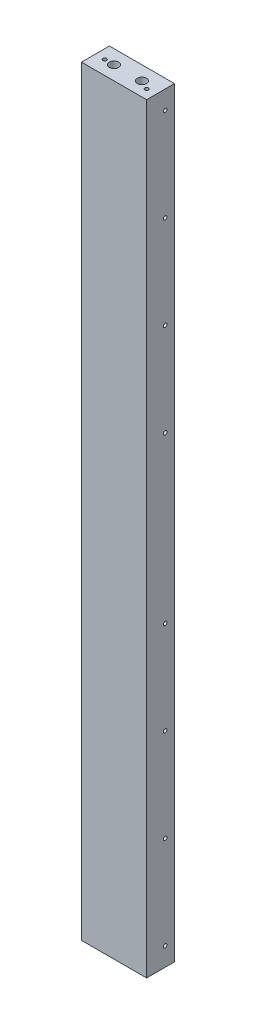
ISO-10303-21;
HEADER;
FILE_DESCRIPTION(('STEP AP214'),'2;1');
FILE_NAME('part.step','',(''),(''),'','','');
FILE_SCHEMA(('AUTOMOTIVE_DESIGN { 1 0 10303 214 1 1 1 1 }'));
ENDSEC;
DATA;
#1=APPLICATION_CONTEXT('core data for automotive mechanical design processes');
#2=APPLICATION_PROTOCOL_DEFINITION('international standard','automotive_design',2000,#1);
#3=PRODUCT_CONTEXT('',#1,'mechanical');
#4=PRODUCT('Part','Part','',(#3));
#5=PRODUCT_RELATED_PRODUCT_CATEGORY('part','',(#4));
#6=PRODUCT_DEFINITION_FORMATION('','',#4);
#7=PRODUCT_DEFINITION_CONTEXT('part definition',#1,'design');
#8=PRODUCT_DEFINITION('design','',#6,#7);
#9=PRODUCT_DEFINITION_SHAPE('','',#8);
#10=(LENGTH_UNIT() NAMED_UNIT(*) SI_UNIT(.MILLI.,.METRE.));
#11=(NAMED_UNIT(*) PLANE_ANGLE_UNIT() SI_UNIT($,.RADIAN.));
#12=(NAMED_UNIT(*) SI_UNIT($,.STERADIAN.) SOLID_ANGLE_UNIT());
#13=UNCERTAINTY_MEASURE_WITH_UNIT(LENGTH_MEASURE(1.E-05),#10,'distance_accuracy_value','');
#14=(GEOMETRIC_REPRESENTATION_CONTEXT(3) GLOBAL_UNCERTAINTY_ASSIGNED_CONTEXT((#13)) GLOBAL_UNIT_ASSIGNED_CONTEXT((#10,
#11,#12)) REPRESENTATION_CONTEXT('',''));
#15=CARTESIAN_POINT('',(0.,0.,0.));
#16=DIRECTION('',(0.,0.,1.));
#17=DIRECTION('',(1.,0.,0.));
#18=AXIS2_PLACEMENT_3D('',#15,#16,#17);
#19=CARTESIAN_POINT('',(0.,1038.225,0.));
#20=DIRECTION('',(1.,0.,0.));
#21=DIRECTION('',(0.,0.,-1.));
#22=AXIS2_PLACEMENT_3D('',#19,#20,#21);
#23=PLANE('',#22);
#24=DIRECTION('',(0.,0.,1.));
#25=VECTOR('',#24,1.);
#26=CARTESIAN_POINT('',(0.,0.,0.));
#27=LINE('',#26,#25);
#28=CARTESIAN_POINT('',(0.,0.,0.));
#29=VERTEX_POINT('',#28);
#30=CARTESIAN_POINT('',(0.,0.,38.1));
#31=VERTEX_POINT('',#30);
#32=EDGE_CURVE('E214',#29,#31,#27,.T.);
#33=ORIENTED_EDGE('',*,*,#32,.T.);
#34=DIRECTION('',(0.,-1.,0.));
#35=VECTOR('',#34,1.);
#36=CARTESIAN_POINT('',(0.,1038.225,38.1));
#37=LINE('',#36,#35);
#38=CARTESIAN_POINT('',(0.,1038.225,38.1));
#39=VERTEX_POINT('',#38);
#40=EDGE_CURVE('E12',#39,#31,#37,.T.);
#41=ORIENTED_EDGE('',*,*,#40,.F.);
#42=DIRECTION('',(0.,0.,1.));
#43=VECTOR('',#42,1.);
#44=CARTESIAN_POINT('',(0.,1038.225,0.));
#45=LINE('',#44,#43);
#46=CARTESIAN_POINT('',(0.,1038.225,0.));
#47=VERTEX_POINT('',#46);
#48=EDGE_CURVE('E221',#47,#39,#45,.T.);
#49=ORIENTED_EDGE('',*,*,#48,.F.);
#50=DIRECTION('',(0.,-1.,0.));
#51=VECTOR('',#50,1.);
#52=CARTESIAN_POINT('',(0.,1038.225,0.));
#53=LINE('',#52,#51);
#54=EDGE_CURVE('E211',#47,#29,#53,.T.);
#55=ORIENTED_EDGE('',*,*,#54,.T.);
#56=EDGE_LOOP('',(#33,#41,#49,#55));
#57=FACE_BOUND('',#56,.T.);
#58=ADVANCED_FACE('F56',(#57),#23,.F.);
#59=CARTESIAN_POINT('',(0.,1038.225,38.1));
#60=DIRECTION('',(0.,0.,-1.));
#61=DIRECTION('',(-1.,0.,0.));
#62=AXIS2_PLACEMENT_3D('',#59,#60,#61);
#63=PLANE('',#62);
#64=DIRECTION('',(1.,0.,0.));
#65=VECTOR('',#64,1.);
#66=CARTESIAN_POINT('',(0.,0.,38.1));
#67=LINE('',#66,#65);
#68=CARTESIAN_POINT('',(88.9,0.,38.1));
#69=VERTEX_POINT('',#68);
#70=EDGE_CURVE('E217',#31,#69,#67,.T.);
#71=ORIENTED_EDGE('',*,*,#70,.T.);
#72=DIRECTION('',(0.,-1.,0.));
#73=VECTOR('',#72,1.);
#74=CARTESIAN_POINT('',(88.9,1038.225,38.1));
#75=LINE('',#74,#73);
#76=CARTESIAN_POINT('',(88.9,1038.225,38.1));
#77=VERTEX_POINT('',#76);
#78=EDGE_CURVE('E64',#77,#69,#75,.T.);
#79=ORIENTED_EDGE('',*,*,#78,.F.);
#80=DIRECTION('',(1.,0.,0.));
#81=VECTOR('',#80,1.);
#82=CARTESIAN_POINT('',(0.,1038.225,38.1));
#83=LINE('',#82,#81);
#84=EDGE_CURVE('E103',#39,#77,#83,.T.);
#85=ORIENTED_EDGE('',*,*,#84,.F.);
#86=ORIENTED_EDGE('',*,*,#40,.T.);
#87=EDGE_LOOP('',(#71,#79,#85,#86));
#88=FACE_BOUND('',#87,.T.);
#89=ADVANCED_FACE('F245',(#88),#63,.F.);
#90=CARTESIAN_POINT('',(88.9,1038.225,0.));
#91=DIRECTION('',(-1.,0.,0.));
#92=DIRECTION('',(0.,0.,1.));
#93=AXIS2_PLACEMENT_3D('',#90,#91,#92);
#94=PLANE('',#93);
#95=CARTESIAN_POINT('',(88.9,25.4,12.7));
#96=DIRECTION('',(1.,0.,0.));
#97=DIRECTION('',(0.,0.,-1.));
#98=AXIS2_PLACEMENT_3D('',#95,#96,#97);
#99=CIRCLE('',#98,2.45744999999999);
#100=CARTESIAN_POINT('',(88.9,25.4,10.24255));
#101=VERTEX_POINT('',#100);
#102=EDGE_CURVE('E148',#101,#101,#99,.T.);
#103=ORIENTED_EDGE('',*,*,#102,.F.);
#104=EDGE_LOOP('',(#103));
#105=FACE_BOUND('',#104,.T.);
#106=CARTESIAN_POINT('',(88.9,152.4,12.7));
#107=DIRECTION('',(1.,0.,0.));
#108=DIRECTION('',(0.,0.,-1.));
#109=AXIS2_PLACEMENT_3D('',#106,#107,#108);
#110=CIRCLE('',#109,2.45745);
#111=CARTESIAN_POINT('',(88.9,152.4,10.24255));
#112=VERTEX_POINT('',#111);
#113=EDGE_CURVE('E147',#112,#112,#110,.T.);
#114=ORIENTED_EDGE('',*,*,#113,.F.);
#115=EDGE_LOOP('',(#114));
#116=FACE_BOUND('',#115,.T.);
#117=CARTESIAN_POINT('',(88.9,279.4,12.7));
#118=DIRECTION('',(1.,0.,0.));
#119=DIRECTION('',(0.,0.,-1.));
#120=AXIS2_PLACEMENT_3D('',#117,#118,#119);
#121=CIRCLE('',#120,2.45744999999997);
#122=CARTESIAN_POINT('',(88.9,279.4,10.24255));
#123=VERTEX_POINT('',#122);
#124=EDGE_CURVE('E158',#123,#123,#121,.T.);
#125=ORIENTED_EDGE('',*,*,#124,.F.);
#126=EDGE_LOOP('',(#125));
#127=FACE_BOUND('',#126,.T.);
#128=CARTESIAN_POINT('',(88.9,406.4,12.7));
#129=DIRECTION('',(1.,0.,0.));
#130=DIRECTION('',(0.,0.,-1.));
#131=AXIS2_PLACEMENT_3D('',#128,#129,#130);
#132=CIRCLE('',#131,2.45744999999997);
#133=CARTESIAN_POINT('',(88.9,406.4,10.24255));
#134=VERTEX_POINT('',#133);
#135=EDGE_CURVE('E164',#134,#134,#132,.T.);
#136=ORIENTED_EDGE('',*,*,#135,.F.);
#137=EDGE_LOOP('',(#136));
#138=FACE_BOUND('',#137,.T.);
#139=CARTESIAN_POINT('',(88.9,631.825,12.7));
#140=DIRECTION('',(1.,0.,0.));
#141=DIRECTION('',(0.,0.,-1.));
#142=AXIS2_PLACEMENT_3D('',#139,#140,#141);
#143=CIRCLE('',#142,2.45744999999997);
#144=CARTESIAN_POINT('',(88.9,631.825,10.24255));
#145=VERTEX_POINT('',#144);
#146=EDGE_CURVE('E170',#145,#145,#143,.T.);
#147=ORIENTED_EDGE('',*,*,#146,.F.);
#148=EDGE_LOOP('',(#147));
#149=FACE_BOUND('',#148,.T.);
#150=CARTESIAN_POINT('',(88.9,758.825,12.7));
#151=DIRECTION('',(1.,0.,0.));
#152=DIRECTION('',(0.,0.,-1.));
#153=AXIS2_PLACEMENT_3D('',#150,#151,#152);
#154=CIRCLE('',#153,2.45744999999997);
#155=CARTESIAN_POINT('',(88.9,758.825,10.24255));
#156=VERTEX_POINT('',#155);
#157=EDGE_CURVE('E176',#156,#156,#154,.T.);
#158=ORIENTED_EDGE('',*,*,#157,.F.);
#159=EDGE_LOOP('',(#158));
#160=FACE_BOUND('',#159,.T.);
#161=CARTESIAN_POINT('',(88.9,885.825,12.7));
#162=DIRECTION('',(1.,0.,0.));
#163=DIRECTION('',(0.,0.,-1.));
#164=AXIS2_PLACEMENT_3D('',#161,#162,#163);
#165=CIRCLE('',#164,2.45744999999997);
#166=CARTESIAN_POINT('',(88.9,885.825,10.24255));
#167=VERTEX_POINT('',#166);
#168=EDGE_CURVE('E182',#167,#167,#165,.T.);
#169=ORIENTED_EDGE('',*,*,#168,.F.);
#170=EDGE_LOOP('',(#169));
#171=FACE_BOUND('',#170,.T.);
#172=CARTESIAN_POINT('',(88.9,1012.825,12.7));
#173=DIRECTION('',(1.,0.,0.));
#174=DIRECTION('',(0.,0.,-1.));
#175=AXIS2_PLACEMENT_3D('',#172,#173,#174);
#176=CIRCLE('',#175,2.45745000000008);
#177=CARTESIAN_POINT('',(88.9,1012.825,10.2425499999999));
#178=VERTEX_POINT('',#177);
#179=EDGE_CURVE('E188',#178,#178,#176,.T.);
#180=ORIENTED_EDGE('',*,*,#179,.F.);
#181=EDGE_LOOP('',(#180));
#182=FACE_BOUND('',#181,.T.);
#183=DIRECTION('',(0.,0.,-1.));
#184=VECTOR('',#183,1.);
#185=CARTESIAN_POINT('',(88.9,0.,0.));
#186=LINE('',#185,#184);
#187=CARTESIAN_POINT('',(88.9,0.,0.));
#188=VERTEX_POINT('',#187);
#189=EDGE_CURVE('E90',#69,#188,#186,.T.);
#190=ORIENTED_EDGE('',*,*,#189,.T.);
#191=DIRECTION('',(0.,-1.,0.));
#192=VECTOR('',#191,1.);
#193=CARTESIAN_POINT('',(88.9,1038.225,0.));
#194=LINE('',#193,#192);
#195=CARTESIAN_POINT('',(88.9,1038.225,0.));
#196=VERTEX_POINT('',#195);
#197=EDGE_CURVE('E224',#196,#188,#194,.T.);
#198=ORIENTED_EDGE('',*,*,#197,.F.);
#199=DIRECTION('',(0.,0.,-1.));
#200=VECTOR('',#199,1.);
#201=CARTESIAN_POINT('',(88.9,1038.225,0.));
#202=LINE('',#201,#200);
#203=EDGE_CURVE('E212',#77,#196,#202,.T.);
#204=ORIENTED_EDGE('',*,*,#203,.F.);
#205=ORIENTED_EDGE('',*,*,#78,.T.);
#206=EDGE_LOOP('',(#190,#198,#204,#205));
#207=FACE_BOUND('',#206,.T.);
#208=ADVANCED_FACE('F226',(#105,#116,#127,#138,#149,#160,#171,#182,#207),#94,.F.);
#209=CARTESIAN_POINT('',(0.,1038.225,0.));
#210=DIRECTION('',(0.,0.,1.));
#211=DIRECTION('',(1.,0.,0.));
#212=AXIS2_PLACEMENT_3D('',#209,#210,#211);
#213=PLANE('',#212);
#214=DIRECTION('',(-1.,0.,0.));
#215=VECTOR('',#214,1.);
#216=CARTESIAN_POINT('',(0.,0.,0.));
#217=LINE('',#216,#215);
#218=EDGE_CURVE('E96',#188,#29,#217,.T.);
#219=ORIENTED_EDGE('',*,*,#218,.T.);
#220=ORIENTED_EDGE('',*,*,#54,.F.);
#221=DIRECTION('',(-1.,0.,0.));
#222=VECTOR('',#221,1.);
#223=CARTESIAN_POINT('',(0.,1038.225,0.));
#224=LINE('',#223,#222);
#225=EDGE_CURVE('E72',#196,#47,#224,.T.);
#226=ORIENTED_EDGE('',*,*,#225,.F.);
#227=ORIENTED_EDGE('',*,*,#197,.T.);
#228=EDGE_LOOP('',(#219,#220,#226,#227));
#229=FACE_BOUND('',#228,.T.);
#230=ADVANCED_FACE('F233',(#229),#213,.F.);
#231=CARTESIAN_POINT('',(0.,1038.225,0.));
#232=DIRECTION('',(0.,1.,0.));
#233=DIRECTION('',(0.,0.,1.));
#234=AXIS2_PLACEMENT_3D('',#231,#232,#233);
#235=PLANE('',#234);
#236=CARTESIAN_POINT('',(12.7,1038.225,19.05));
#237=DIRECTION('',(0.,1.,0.));
#238=DIRECTION('',(0.,0.,1.));
#239=AXIS2_PLACEMENT_3D('',#236,#237,#238);
#240=CIRCLE('',#239,2.45744999999999);
#241=CARTESIAN_POINT('',(12.7,1038.225,21.50745));
#242=VERTEX_POINT('',#241);
#243=EDGE_CURVE('E200',#242,#242,#240,.T.);
#244=ORIENTED_EDGE('',*,*,#243,.F.);
#245=EDGE_LOOP('',(#244));
#246=FACE_BOUND('',#245,.T.);
#247=CARTESIAN_POINT('',(76.2,1038.225,25.4));
#248=DIRECTION('',(0.,1.,0.));
#249=DIRECTION('',(0.,0.,1.));
#250=AXIS2_PLACEMENT_3D('',#247,#248,#249);
#251=CIRCLE('',#250,2.45744999999999);
#252=CARTESIAN_POINT('',(76.2,1038.225,27.85745));
#253=VERTEX_POINT('',#252);
#254=EDGE_CURVE('E651',#253,#253,#251,.T.);
#255=ORIENTED_EDGE('',*,*,#254,.F.);
#256=EDGE_LOOP('',(#255));
#257=FACE_BOUND('',#256,.T.);
#258=CARTESIAN_POINT('',(25.4,1038.225,19.05));
#259=DIRECTION('',(0.,1.,0.));
#260=DIRECTION('',(0.,0.,1.));
#261=AXIS2_PLACEMENT_3D('',#258,#259,#260);
#262=CIRCLE('',#261,6.35000000000001);
#263=CARTESIAN_POINT('',(25.4,1038.225,25.4));
#264=VERTEX_POINT('',#263);
#265=EDGE_CURVE('E637',#264,#264,#262,.T.);
#266=ORIENTED_EDGE('',*,*,#265,.F.);
#267=EDGE_LOOP('',(#266));
#268=FACE_BOUND('',#267,.T.);
#269=CARTESIAN_POINT('',(63.5,1038.225,19.05));
#270=DIRECTION('',(0.,1.,0.));
#271=DIRECTION('',(0.,0.,1.));
#272=AXIS2_PLACEMENT_3D('',#269,#270,#271);
#273=CIRCLE('',#272,6.35000000000001);
#274=CARTESIAN_POINT('',(63.5,1038.225,25.4));
#275=VERTEX_POINT('',#274);
#276=EDGE_CURVE('E640',#275,#275,#273,.T.);
#277=ORIENTED_EDGE('',*,*,#276,.F.);
#278=EDGE_LOOP('',(#277));
#279=FACE_BOUND('',#278,.T.);
#280=ORIENTED_EDGE('',*,*,#48,.T.);
#281=ORIENTED_EDGE('',*,*,#84,.T.);
#282=ORIENTED_EDGE('',*,*,#203,.T.);
#283=ORIENTED_EDGE('',*,*,#225,.T.);
#284=EDGE_LOOP('',(#280,#281,#282,#283));
#285=FACE_BOUND('',#284,.T.);
#286=ADVANCED_FACE('F235',(#246,#257,#268,#279,#285),#235,.T.);
#287=CARTESIAN_POINT('',(0.,0.,0.));
#288=DIRECTION('',(0.,1.,0.));
#289=DIRECTION('',(0.,0.,1.));
#290=AXIS2_PLACEMENT_3D('',#287,#288,#289);
#291=PLANE('',#290);
#292=CARTESIAN_POINT('',(44.45,0.,25.4));
#293=DIRECTION('',(0.,-1.,0.));
#294=DIRECTION('',(0.,0.,-1.));
#295=AXIS2_PLACEMENT_3D('',#292,#293,#294);
#296=CIRCLE('',#295,2.45744999999999);
#297=CARTESIAN_POINT('',(44.45,0.,22.94255));
#298=VERTEX_POINT('',#297);
#299=EDGE_CURVE('E194',#298,#298,#296,.T.);
#300=ORIENTED_EDGE('',*,*,#299,.F.);
#301=EDGE_LOOP('',(#300));
#302=FACE_BOUND('',#301,.T.);
#303=CARTESIAN_POINT('',(25.4,0.,19.05));
#304=DIRECTION('',(0.,-1.,0.));
#305=DIRECTION('',(0.,0.,-1.));
#306=AXIS2_PLACEMENT_3D('',#303,#304,#305);
#307=CIRCLE('',#306,6.35000000000001);
#308=CARTESIAN_POINT('',(25.4,0.,12.7));
#309=VERTEX_POINT('',#308);
#310=EDGE_CURVE('E621',#309,#309,#307,.T.);
#311=ORIENTED_EDGE('',*,*,#310,.F.);
#312=EDGE_LOOP('',(#311));
#313=FACE_BOUND('',#312,.T.);
#314=CARTESIAN_POINT('',(63.5,0.,19.05));
#315=DIRECTION('',(0.,-1.,0.));
#316=DIRECTION('',(0.,0.,-1.));
#317=AXIS2_PLACEMENT_3D('',#314,#315,#316);
#318=CIRCLE('',#317,6.35);
#319=CARTESIAN_POINT('',(63.5,0.,12.7));
#320=VERTEX_POINT('',#319);
#321=EDGE_CURVE('E624',#320,#320,#318,.T.);
#322=ORIENTED_EDGE('',*,*,#321,.F.);
#323=EDGE_LOOP('',(#322));
#324=FACE_BOUND('',#323,.T.);
#325=ORIENTED_EDGE('',*,*,#32,.F.);
#326=ORIENTED_EDGE('',*,*,#218,.F.);
#327=ORIENTED_EDGE('',*,*,#189,.F.);
#328=ORIENTED_EDGE('',*,*,#70,.F.);
#329=EDGE_LOOP('',(#325,#326,#327,#328));
#330=FACE_BOUND('',#329,.T.);
#331=ADVANCED_FACE('F229',(#302,#313,#324,#330),#291,.F.);
#332=CARTESIAN_POINT('',(63.5,1019.175,19.05));
#333=DIRECTION('',(0.,1.,0.));
#334=DIRECTION('',(0.,0.,1.));
#335=AXIS2_PLACEMENT_3D('',#332,#333,#334);
#336=CYLINDRICAL_SURFACE('',#335,6.35000000000001);
#337=CARTESIAN_POINT('',(63.5,1019.175,19.05));
#338=DIRECTION('',(0.,1.,0.));
#339=DIRECTION('',(0.,0.,1.));
#340=AXIS2_PLACEMENT_3D('',#337,#338,#339);
#341=CIRCLE('',#340,6.35000000000001);
#342=CARTESIAN_POINT('',(63.5,1019.175,25.4));
#343=VERTEX_POINT('',#342);
#344=EDGE_CURVE('E643',#343,#343,#341,.T.);
#345=ORIENTED_EDGE('',*,*,#344,.F.);
#346=EDGE_LOOP('',(#345));
#347=FACE_BOUND('',#346,.T.);
#348=ORIENTED_EDGE('',*,*,#276,.T.);
#349=EDGE_LOOP('',(#348));
#350=FACE_BOUND('',#349,.T.);
#351=ADVANCED_FACE('F286',(#347,#350),#336,.F.);
#352=CARTESIAN_POINT('',(63.5,1019.175,19.05));
#353=DIRECTION('',(0.,1.,0.));
#354=DIRECTION('',(0.,0.,1.));
#355=AXIS2_PLACEMENT_3D('',#352,#353,#354);
#356=PLANE('',#355);
#357=ORIENTED_EDGE('',*,*,#344,.T.);
#358=EDGE_LOOP('',(#357));
#359=FACE_BOUND('',#358,.T.);
#360=ADVANCED_FACE('F295',(#359),#356,.T.);
#361=CARTESIAN_POINT('',(25.4,1019.175,19.05));
#362=DIRECTION('',(0.,1.,0.));
#363=DIRECTION('',(0.,0.,1.));
#364=AXIS2_PLACEMENT_3D('',#361,#362,#363);
#365=CYLINDRICAL_SURFACE('',#364,6.35000000000001);
#366=CARTESIAN_POINT('',(25.4,1019.175,19.05));
#367=DIRECTION('',(0.,1.,0.));
#368=DIRECTION('',(0.,0.,1.));
#369=AXIS2_PLACEMENT_3D('',#366,#367,#368);
#370=CIRCLE('',#369,6.35000000000001);
#371=CARTESIAN_POINT('',(25.4,1019.175,25.4));
#372=VERTEX_POINT('',#371);
#373=EDGE_CURVE('E218',#372,#372,#370,.T.);
#374=ORIENTED_EDGE('',*,*,#373,.F.);
#375=EDGE_LOOP('',(#374));
#376=FACE_BOUND('',#375,.T.);
#377=ORIENTED_EDGE('',*,*,#265,.T.);
#378=EDGE_LOOP('',(#377));
#379=FACE_BOUND('',#378,.T.);
#380=ADVANCED_FACE('F305',(#376,#379),#365,.F.);
#381=CARTESIAN_POINT('',(25.4,1019.175,19.05));
#382=DIRECTION('',(0.,1.,0.));
#383=DIRECTION('',(0.,0.,1.));
#384=AXIS2_PLACEMENT_3D('',#381,#382,#383);
#385=PLANE('',#384);
#386=ORIENTED_EDGE('',*,*,#373,.T.);
#387=EDGE_LOOP('',(#386));
#388=FACE_BOUND('',#387,.T.);
#389=ADVANCED_FACE('F315',(#388),#385,.T.);
#390=CARTESIAN_POINT('',(63.5,19.05,19.05));
#391=DIRECTION('',(0.,-1.,0.));
#392=DIRECTION('',(0.,0.,-1.));
#393=AXIS2_PLACEMENT_3D('',#390,#391,#392);
#394=CYLINDRICAL_SURFACE('',#393,6.35);
#395=CARTESIAN_POINT('',(63.5,19.05,19.05));
#396=DIRECTION('',(0.,-1.,0.));
#397=DIRECTION('',(0.,0.,-1.));
#398=AXIS2_PLACEMENT_3D('',#395,#396,#397);
#399=CIRCLE('',#398,6.35);
#400=CARTESIAN_POINT('',(63.5,19.05,12.7));
#401=VERTEX_POINT('',#400);
#402=EDGE_CURVE('E626',#401,#401,#399,.T.);
#403=ORIENTED_EDGE('',*,*,#402,.F.);
#404=EDGE_LOOP('',(#403));
#405=FACE_BOUND('',#404,.T.);
#406=ORIENTED_EDGE('',*,*,#321,.T.);
#407=EDGE_LOOP('',(#406));
#408=FACE_BOUND('',#407,.T.);
#409=ADVANCED_FACE('F325',(#405,#408),#394,.F.);
#410=CARTESIAN_POINT('',(63.5,19.05,19.05));
#411=DIRECTION('',(0.,-1.,0.));
#412=DIRECTION('',(0.,0.,-1.));
#413=AXIS2_PLACEMENT_3D('',#410,#411,#412);
#414=PLANE('',#413);
#415=ORIENTED_EDGE('',*,*,#402,.T.);
#416=EDGE_LOOP('',(#415));
#417=FACE_BOUND('',#416,.T.);
#418=ADVANCED_FACE('F335',(#417),#414,.T.);
#419=CARTESIAN_POINT('',(25.4,19.05,19.05));
#420=DIRECTION('',(0.,-1.,0.));
#421=DIRECTION('',(0.,0.,-1.));
#422=AXIS2_PLACEMENT_3D('',#419,#420,#421);
#423=CYLINDRICAL_SURFACE('',#422,6.35000000000001);
#424=CARTESIAN_POINT('',(25.4,19.05,19.05));
#425=DIRECTION('',(0.,-1.,0.));
#426=DIRECTION('',(0.,0.,-1.));
#427=AXIS2_PLACEMENT_3D('',#424,#425,#426);
#428=CIRCLE('',#427,6.35000000000001);
#429=CARTESIAN_POINT('',(25.4,19.05,12.7));
#430=VERTEX_POINT('',#429);
#431=EDGE_CURVE('E628',#430,#430,#428,.T.);
#432=ORIENTED_EDGE('',*,*,#431,.F.);
#433=EDGE_LOOP('',(#432));
#434=FACE_BOUND('',#433,.T.);
#435=ORIENTED_EDGE('',*,*,#310,.T.);
#436=EDGE_LOOP('',(#435));
#437=FACE_BOUND('',#436,.T.);
#438=ADVANCED_FACE('F345',(#434,#437),#423,.F.);
#439=CARTESIAN_POINT('',(25.4,19.05,19.05));
#440=DIRECTION('',(0.,-1.,0.));
#441=DIRECTION('',(0.,0.,-1.));
#442=AXIS2_PLACEMENT_3D('',#439,#440,#441);
#443=PLANE('',#442);
#444=ORIENTED_EDGE('',*,*,#431,.T.);
#445=EDGE_LOOP('',(#444));
#446=FACE_BOUND('',#445,.T.);
#447=ADVANCED_FACE('F355',(#446),#443,.T.);
#448=CARTESIAN_POINT('',(76.2,962.025,25.4));
#449=DIRECTION('',(0.,1.,0.));
#450=DIRECTION('',(0.,0.,1.));
#451=AXIS2_PLACEMENT_3D('',#448,#449,#450);
#452=CONICAL_SURFACE('',#451,2.45744999999997,1.02974425867666);
#453=CARTESIAN_POINT('',(76.2,960.548415071771,25.4));
#454=VERTEX_POINT('',#453);
#455=VERTEX_LOOP('',#454);
#456=FACE_BOUND('',#455,.T.);
#457=CARTESIAN_POINT('',(76.2,962.025,25.4));
#458=DIRECTION('',(0.,1.,0.));
#459=DIRECTION('',(0.,0.,1.));
#460=AXIS2_PLACEMENT_3D('',#457,#458,#459);
#461=CIRCLE('',#460,2.45744999999997);
#462=CARTESIAN_POINT('',(76.2,962.025,27.85745));
#463=VERTEX_POINT('',#462);
#464=EDGE_CURVE('E631',#463,#463,#461,.T.);
#465=ORIENTED_EDGE('',*,*,#464,.T.);
#466=EDGE_LOOP('',(#465));
#467=FACE_BOUND('',#466,.T.);
#468=ADVANCED_FACE('F364',(#456,#467),#452,.F.);
#469=CARTESIAN_POINT('',(76.2,1038.225,25.4));
#470=DIRECTION('',(0.,1.,0.));
#471=DIRECTION('',(0.,0.,1.));
#472=AXIS2_PLACEMENT_3D('',#469,#470,#471);
#473=CYLINDRICAL_SURFACE('',#472,2.45744999999998);
#474=ORIENTED_EDGE('',*,*,#464,.F.);
#475=EDGE_LOOP('',(#474));
#476=FACE_BOUND('',#475,.T.);
#477=ORIENTED_EDGE('',*,*,#254,.T.);
#478=EDGE_LOOP('',(#477));
#479=FACE_BOUND('',#478,.T.);
#480=ADVANCED_FACE('F373',(#476,#479),#473,.F.);
#481=CARTESIAN_POINT('',(12.7,962.025,19.05));
#482=DIRECTION('',(0.,1.,0.));
#483=DIRECTION('',(0.,0.,1.));
#484=AXIS2_PLACEMENT_3D('',#481,#482,#483);
#485=CONICAL_SURFACE('',#484,2.45744999999998,1.02974425867667);
#486=CARTESIAN_POINT('',(12.7,960.548415071771,19.05));
#487=VERTEX_POINT('',#486);
#488=VERTEX_LOOP('',#487);
#489=FACE_BOUND('',#488,.T.);
#490=CARTESIAN_POINT('',(12.7,962.025,19.05));
#491=DIRECTION('',(0.,1.,0.));
#492=DIRECTION('',(0.,0.,1.));
#493=AXIS2_PLACEMENT_3D('',#490,#491,#492);
#494=CIRCLE('',#493,2.45744999999998);
#495=CARTESIAN_POINT('',(12.7,962.025,21.50745));
#496=VERTEX_POINT('',#495);
#497=EDGE_CURVE('E204',#496,#496,#494,.T.);
#498=ORIENTED_EDGE('',*,*,#497,.T.);
#499=EDGE_LOOP('',(#498));
#500=FACE_BOUND('',#499,.T.);
#501=ADVANCED_FACE('F383',(#489,#500),#485,.F.);
#502=CARTESIAN_POINT('',(12.7,1038.225,19.05));
#503=DIRECTION('',(0.,1.,0.));
#504=DIRECTION('',(0.,0.,1.));
#505=AXIS2_PLACEMENT_3D('',#502,#503,#504);
#506=CYLINDRICAL_SURFACE('',#505,2.45744999999998);
#507=ORIENTED_EDGE('',*,*,#497,.F.);
#508=EDGE_LOOP('',(#507));
#509=FACE_BOUND('',#508,.T.);
#510=ORIENTED_EDGE('',*,*,#243,.T.);
#511=EDGE_LOOP('',(#510));
#512=FACE_BOUND('',#511,.T.);
#513=ADVANCED_FACE('F393',(#509,#512),#506,.F.);
#514=CARTESIAN_POINT('',(44.45,76.2,25.4));
#515=DIRECTION('',(0.,-1.,0.));
#516=DIRECTION('',(0.,0.,-1.));
#517=AXIS2_PLACEMENT_3D('',#514,#515,#516);
#518=CONICAL_SURFACE('',#517,2.45744999999998,1.02974425867664);
#519=CARTESIAN_POINT('',(44.45,77.6765849282293,25.4));
#520=VERTEX_POINT('',#519);
#521=VERTEX_LOOP('',#520);
#522=FACE_BOUND('',#521,.T.);
#523=CARTESIAN_POINT('',(44.45,76.2,25.4));
#524=DIRECTION('',(0.,-1.,0.));
#525=DIRECTION('',(0.,0.,-1.));
#526=AXIS2_PLACEMENT_3D('',#523,#524,#525);
#527=CIRCLE('',#526,2.45744999999998);
#528=CARTESIAN_POINT('',(44.45,76.2,22.94255));
#529=VERTEX_POINT('',#528);
#530=EDGE_CURVE('E197',#529,#529,#527,.T.);
#531=ORIENTED_EDGE('',*,*,#530,.T.);
#532=EDGE_LOOP('',(#531));
#533=FACE_BOUND('',#532,.T.);
#534=ADVANCED_FACE('F403',(#522,#533),#518,.F.);
#535=CARTESIAN_POINT('',(44.45,0.,25.4));
#536=DIRECTION('',(0.,-1.,0.));
#537=DIRECTION('',(0.,0.,-1.));
#538=AXIS2_PLACEMENT_3D('',#535,#536,#537);
#539=CYLINDRICAL_SURFACE('',#538,2.45744999999999);
#540=ORIENTED_EDGE('',*,*,#530,.F.);
#541=EDGE_LOOP('',(#540));
#542=FACE_BOUND('',#541,.T.);
#543=ORIENTED_EDGE('',*,*,#299,.T.);
#544=EDGE_LOOP('',(#543));
#545=FACE_BOUND('',#544,.T.);
#546=ADVANCED_FACE('F413',(#542,#545),#539,.F.);
#547=CARTESIAN_POINT('',(38.1,1012.825,12.7));
#548=DIRECTION('',(1.,0.,0.));
#549=DIRECTION('',(0.,0.,-1.));
#550=AXIS2_PLACEMENT_3D('',#547,#548,#549);
#551=CONICAL_SURFACE('',#550,2.45745000000008,1.02974425867667);
#552=CARTESIAN_POINT('',(36.6234150717707,1012.825,12.7));
#553=VERTEX_POINT('',#552);
#554=VERTEX_LOOP('',#553);
#555=FACE_BOUND('',#554,.T.);
#556=CARTESIAN_POINT('',(38.1,1012.825,12.7));
#557=DIRECTION('',(1.,0.,0.));
#558=DIRECTION('',(0.,0.,-1.));
#559=AXIS2_PLACEMENT_3D('',#556,#557,#558);
#560=CIRCLE('',#559,2.45745000000008);
#561=CARTESIAN_POINT('',(38.1,1012.825,10.2425499999999));
#562=VERTEX_POINT('',#561);
#563=EDGE_CURVE('E191',#562,#562,#560,.T.);
#564=ORIENTED_EDGE('',*,*,#563,.T.);
#565=EDGE_LOOP('',(#564));
#566=FACE_BOUND('',#565,.T.);
#567=ADVANCED_FACE('F422',(#555,#566),#551,.F.);
#568=CARTESIAN_POINT('',(88.9,1012.825,12.7));
#569=DIRECTION('',(1.,0.,0.));
#570=DIRECTION('',(0.,0.,-1.));
#571=AXIS2_PLACEMENT_3D('',#568,#569,#570);
#572=CYLINDRICAL_SURFACE('',#571,2.45745000000008);
#573=ORIENTED_EDGE('',*,*,#563,.F.);
#574=EDGE_LOOP('',(#573));
#575=FACE_BOUND('',#574,.T.);
#576=ORIENTED_EDGE('',*,*,#179,.T.);
#577=EDGE_LOOP('',(#576));
#578=FACE_BOUND('',#577,.T.);
#579=ADVANCED_FACE('F431',(#575,#578),#572,.F.);
#580=CARTESIAN_POINT('',(38.1,885.825,12.7));
#581=DIRECTION('',(1.,0.,0.));
#582=DIRECTION('',(0.,0.,-1.));
#583=AXIS2_PLACEMENT_3D('',#580,#581,#582);
#584=CONICAL_SURFACE('',#583,2.45744999999997,1.02974425867665);
#585=CARTESIAN_POINT('',(36.6234150717707,885.825,12.7));
#586=VERTEX_POINT('',#585);
#587=VERTEX_LOOP('',#586);
#588=FACE_BOUND('',#587,.T.);
#589=CARTESIAN_POINT('',(38.1,885.825,12.7));
#590=DIRECTION('',(1.,0.,0.));
#591=DIRECTION('',(0.,0.,-1.));
#592=AXIS2_PLACEMENT_3D('',#589,#590,#591);
#593=CIRCLE('',#592,2.45744999999997);
#594=CARTESIAN_POINT('',(38.1,885.825,10.24255));
#595=VERTEX_POINT('',#594);
#596=EDGE_CURVE('E185',#595,#595,#593,.T.);
#597=ORIENTED_EDGE('',*,*,#596,.T.);
#598=EDGE_LOOP('',(#597));
#599=FACE_BOUND('',#598,.T.);
#600=ADVANCED_FACE('F441',(#588,#599),#584,.F.);
#601=CARTESIAN_POINT('',(88.9,885.825,12.7));
#602=DIRECTION('',(1.,0.,0.));
#603=DIRECTION('',(0.,0.,-1.));
#604=AXIS2_PLACEMENT_3D('',#601,#602,#603);
#605=CYLINDRICAL_SURFACE('',#604,2.45744999999997);
#606=ORIENTED_EDGE('',*,*,#596,.F.);
#607=EDGE_LOOP('',(#606));
#608=FACE_BOUND('',#607,.T.);
#609=ORIENTED_EDGE('',*,*,#168,.T.);
#610=EDGE_LOOP('',(#609));
#611=FACE_BOUND('',#610,.T.);
#612=ADVANCED_FACE('F451',(#608,#611),#605,.F.);
#613=CARTESIAN_POINT('',(38.1,758.825,12.7));
#614=DIRECTION('',(1.,0.,0.));
#615=DIRECTION('',(0.,0.,-1.));
#616=AXIS2_PLACEMENT_3D('',#613,#614,#615);
#617=CONICAL_SURFACE('',#616,2.45744999999997,1.02974425867665);
#618=CARTESIAN_POINT('',(36.6234150717707,758.825,12.7));
#619=VERTEX_POINT('',#618);
#620=VERTEX_LOOP('',#619);
#621=FACE_BOUND('',#620,.T.);
#622=CARTESIAN_POINT('',(38.1,758.825,12.7));
#623=DIRECTION('',(1.,0.,0.));
#624=DIRECTION('',(0.,0.,-1.));
#625=AXIS2_PLACEMENT_3D('',#622,#623,#624);
#626=CIRCLE('',#625,2.45744999999997);
#627=CARTESIAN_POINT('',(38.1,758.825,10.24255));
#628=VERTEX_POINT('',#627);
#629=EDGE_CURVE('E179',#628,#628,#626,.T.);
#630=ORIENTED_EDGE('',*,*,#629,.T.);
#631=EDGE_LOOP('',(#630));
#632=FACE_BOUND('',#631,.T.);
#633=ADVANCED_FACE('F461',(#621,#632),#617,.F.);
#634=CARTESIAN_POINT('',(88.9,758.825,12.7));
#635=DIRECTION('',(1.,0.,0.));
#636=DIRECTION('',(0.,0.,-1.));
#637=AXIS2_PLACEMENT_3D('',#634,#635,#636);
#638=CYLINDRICAL_SURFACE('',#637,2.45744999999997);
#639=ORIENTED_EDGE('',*,*,#629,.F.);
#640=EDGE_LOOP('',(#639));
#641=FACE_BOUND('',#640,.T.);
#642=ORIENTED_EDGE('',*,*,#157,.T.);
#643=EDGE_LOOP('',(#642));
#644=FACE_BOUND('',#643,.T.);
#645=ADVANCED_FACE('F471',(#641,#644),#638,.F.);
#646=CARTESIAN_POINT('',(38.1,631.825,12.7));
#647=DIRECTION('',(1.,0.,0.));
#648=DIRECTION('',(0.,0.,-1.));
#649=AXIS2_PLACEMENT_3D('',#646,#647,#648);
#650=CONICAL_SURFACE('',#649,2.45744999999997,1.02974425867665);
#651=CARTESIAN_POINT('',(36.6234150717707,631.825,12.7));
#652=VERTEX_POINT('',#651);
#653=VERTEX_LOOP('',#652);
#654=FACE_BOUND('',#653,.T.);
#655=CARTESIAN_POINT('',(38.1,631.825,12.7));
#656=DIRECTION('',(1.,0.,0.));
#657=DIRECTION('',(0.,0.,-1.));
#658=AXIS2_PLACEMENT_3D('',#655,#656,#657);
#659=CIRCLE('',#658,2.45744999999997);
#660=CARTESIAN_POINT('',(38.1,631.825,10.24255));
#661=VERTEX_POINT('',#660);
#662=EDGE_CURVE('E173',#661,#661,#659,.T.);
#663=ORIENTED_EDGE('',*,*,#662,.T.);
#664=EDGE_LOOP('',(#663));
#665=FACE_BOUND('',#664,.T.);
#666=ADVANCED_FACE('F481',(#654,#665),#650,.F.);
#667=CARTESIAN_POINT('',(88.9,631.825,12.7));
#668=DIRECTION('',(1.,0.,0.));
#669=DIRECTION('',(0.,0.,-1.));
#670=AXIS2_PLACEMENT_3D('',#667,#668,#669);
#671=CYLINDRICAL_SURFACE('',#670,2.45744999999997);
#672=ORIENTED_EDGE('',*,*,#662,.F.);
#673=EDGE_LOOP('',(#672));
#674=FACE_BOUND('',#673,.T.);
#675=ORIENTED_EDGE('',*,*,#146,.T.);
#676=EDGE_LOOP('',(#675));
#677=FACE_BOUND('',#676,.T.);
#678=ADVANCED_FACE('F491',(#674,#677),#671,.F.);
#679=CARTESIAN_POINT('',(38.1,406.4,12.7));
#680=DIRECTION('',(1.,0.,0.));
#681=DIRECTION('',(0.,0.,-1.));
#682=AXIS2_PLACEMENT_3D('',#679,#680,#681);
#683=CONICAL_SURFACE('',#682,2.45744999999997,1.02974425867665);
#684=CARTESIAN_POINT('',(36.6234150717707,406.4,12.7));
#685=VERTEX_POINT('',#684);
#686=VERTEX_LOOP('',#685);
#687=FACE_BOUND('',#686,.T.);
#688=CARTESIAN_POINT('',(38.1,406.4,12.7));
#689=DIRECTION('',(1.,0.,0.));
#690=DIRECTION('',(0.,0.,-1.));
#691=AXIS2_PLACEMENT_3D('',#688,#689,#690);
#692=CIRCLE('',#691,2.45744999999997);
#693=CARTESIAN_POINT('',(38.1,406.4,10.24255));
#694=VERTEX_POINT('',#693);
#695=EDGE_CURVE('E167',#694,#694,#692,.T.);
#696=ORIENTED_EDGE('',*,*,#695,.T.);
#697=EDGE_LOOP('',(#696));
#698=FACE_BOUND('',#697,.T.);
#699=ADVANCED_FACE('F501',(#687,#698),#683,.F.);
#700=CARTESIAN_POINT('',(88.9,406.4,12.7));
#701=DIRECTION('',(1.,0.,0.));
#702=DIRECTION('',(0.,0.,-1.));
#703=AXIS2_PLACEMENT_3D('',#700,#701,#702);
#704=CYLINDRICAL_SURFACE('',#703,2.45744999999997);
#705=ORIENTED_EDGE('',*,*,#695,.F.);
#706=EDGE_LOOP('',(#705));
#707=FACE_BOUND('',#706,.T.);
#708=ORIENTED_EDGE('',*,*,#135,.T.);
#709=EDGE_LOOP('',(#708));
#710=FACE_BOUND('',#709,.T.);
#711=ADVANCED_FACE('F511',(#707,#710),#704,.F.);
#712=CARTESIAN_POINT('',(38.1,279.4,12.7));
#713=DIRECTION('',(1.,0.,0.));
#714=DIRECTION('',(0.,0.,-1.));
#715=AXIS2_PLACEMENT_3D('',#712,#713,#714);
#716=CONICAL_SURFACE('',#715,2.45744999999997,1.02974425867665);
#717=CARTESIAN_POINT('',(36.6234150717707,279.4,12.7));
#718=VERTEX_POINT('',#717);
#719=VERTEX_LOOP('',#718);
#720=FACE_BOUND('',#719,.T.);
#721=CARTESIAN_POINT('',(38.1,279.4,12.7));
#722=DIRECTION('',(1.,0.,0.));
#723=DIRECTION('',(0.,0.,-1.));
#724=AXIS2_PLACEMENT_3D('',#721,#722,#723);
#725=CIRCLE('',#724,2.45744999999997);
#726=CARTESIAN_POINT('',(38.1,279.4,10.24255));
#727=VERTEX_POINT('',#726);
#728=EDGE_CURVE('E161',#727,#727,#725,.T.);
#729=ORIENTED_EDGE('',*,*,#728,.T.);
#730=EDGE_LOOP('',(#729));
#731=FACE_BOUND('',#730,.T.);
#732=ADVANCED_FACE('F521',(#720,#731),#716,.F.);
#733=CARTESIAN_POINT('',(88.9,279.4,12.7));
#734=DIRECTION('',(1.,0.,0.));
#735=DIRECTION('',(0.,0.,-1.));
#736=AXIS2_PLACEMENT_3D('',#733,#734,#735);
#737=CYLINDRICAL_SURFACE('',#736,2.45744999999997);
#738=ORIENTED_EDGE('',*,*,#728,.F.);
#739=EDGE_LOOP('',(#738));
#740=FACE_BOUND('',#739,.T.);
#741=ORIENTED_EDGE('',*,*,#124,.T.);
#742=EDGE_LOOP('',(#741));
#743=FACE_BOUND('',#742,.T.);
#744=ADVANCED_FACE('F531',(#740,#743),#737,.F.);
#745=CARTESIAN_POINT('',(38.1,152.4,12.7));
#746=DIRECTION('',(1.,0.,0.));
#747=DIRECTION('',(0.,0.,-1.));
#748=AXIS2_PLACEMENT_3D('',#745,#746,#747);
#749=CONICAL_SURFACE('',#748,2.45745,1.02974425867665);
#750=CARTESIAN_POINT('',(36.6234150717707,152.4,12.7));
#751=VERTEX_POINT('',#750);
#752=VERTEX_LOOP('',#751);
#753=FACE_BOUND('',#752,.T.);
#754=CARTESIAN_POINT('',(38.1,152.4,12.7));
#755=DIRECTION('',(1.,0.,0.));
#756=DIRECTION('',(0.,0.,-1.));
#757=AXIS2_PLACEMENT_3D('',#754,#755,#756);
#758=CIRCLE('',#757,2.45745);
#759=CARTESIAN_POINT('',(38.1,152.4,10.24255));
#760=VERTEX_POINT('',#759);
#761=EDGE_CURVE('E151',#760,#760,#758,.T.);
#762=ORIENTED_EDGE('',*,*,#761,.T.);
#763=EDGE_LOOP('',(#762));
#764=FACE_BOUND('',#763,.T.);
#765=ADVANCED_FACE('F541',(#753,#764),#749,.F.);
#766=CARTESIAN_POINT('',(88.9,152.4,12.7));
#767=DIRECTION('',(1.,0.,0.));
#768=DIRECTION('',(0.,0.,-1.));
#769=AXIS2_PLACEMENT_3D('',#766,#767,#768);
#770=CYLINDRICAL_SURFACE('',#769,2.45745);
#771=ORIENTED_EDGE('',*,*,#761,.F.);
#772=EDGE_LOOP('',(#771));
#773=FACE_BOUND('',#772,.T.);
#774=ORIENTED_EDGE('',*,*,#113,.T.);
#775=EDGE_LOOP('',(#774));
#776=FACE_BOUND('',#775,.T.);
#777=ADVANCED_FACE('F141',(#773,#776),#770,.F.);
#778=CARTESIAN_POINT('',(38.1,25.4,12.7));
#779=DIRECTION('',(1.,0.,0.));
#780=DIRECTION('',(0.,0.,-1.));
#781=AXIS2_PLACEMENT_3D('',#778,#779,#780);
#782=CONICAL_SURFACE('',#781,2.45744999999999,1.02974425867665);
#783=CARTESIAN_POINT('',(36.6234150717707,25.4,12.7));
#784=VERTEX_POINT('',#783);
#785=VERTEX_LOOP('',#784);
#786=FACE_BOUND('',#785,.T.);
#787=CARTESIAN_POINT('',(38.1,25.4,12.7));
#788=DIRECTION('',(1.,0.,0.));
#789=DIRECTION('',(0.,0.,-1.));
#790=AXIS2_PLACEMENT_3D('',#787,#788,#789);
#791=CIRCLE('',#790,2.45744999999999);
#792=CARTESIAN_POINT('',(38.1,25.4,10.24255));
#793=VERTEX_POINT('',#792);
#794=EDGE_CURVE('E145',#793,#793,#791,.T.);
#795=ORIENTED_EDGE('',*,*,#794,.T.);
#796=EDGE_LOOP('',(#795));
#797=FACE_BOUND('',#796,.T.);
#798=ADVANCED_FACE('F137',(#786,#797),#782,.F.);
#799=CARTESIAN_POINT('',(88.9,25.4,12.7));
#800=DIRECTION('',(1.,0.,0.));
#801=DIRECTION('',(0.,0.,-1.));
#802=AXIS2_PLACEMENT_3D('',#799,#800,#801);
#803=CYLINDRICAL_SURFACE('',#802,2.45744999999999);
#804=ORIENTED_EDGE('',*,*,#794,.F.);
#805=EDGE_LOOP('',(#804));
#806=FACE_BOUND('',#805,.T.);
#807=ORIENTED_EDGE('',*,*,#102,.T.);
#808=EDGE_LOOP('',(#807));
#809=FACE_BOUND('',#808,.T.);
#810=ADVANCED_FACE('F140',(#806,#809),#803,.F.);
#811=CLOSED_SHELL('',(#58,#89,#208,#230,#286,#331,#351,#360,#380,#389,#409,#418,#438,#447,#468,
#480,#501,#513,#534,#546,#567,#579,#600,#612,#633,#645,#666,#678,#699,#711,#732,#744,#765,#777,
#798,#810));
#812=MANIFOLD_SOLID_BREP('B2',#811);
#813=ADVANCED_BREP_SHAPE_REPRESENTATION('',(#18,#812),#14);
#814=SHAPE_DEFINITION_REPRESENTATION(#9,#813);
ENDSEC;
END-ISO-10303-21;
